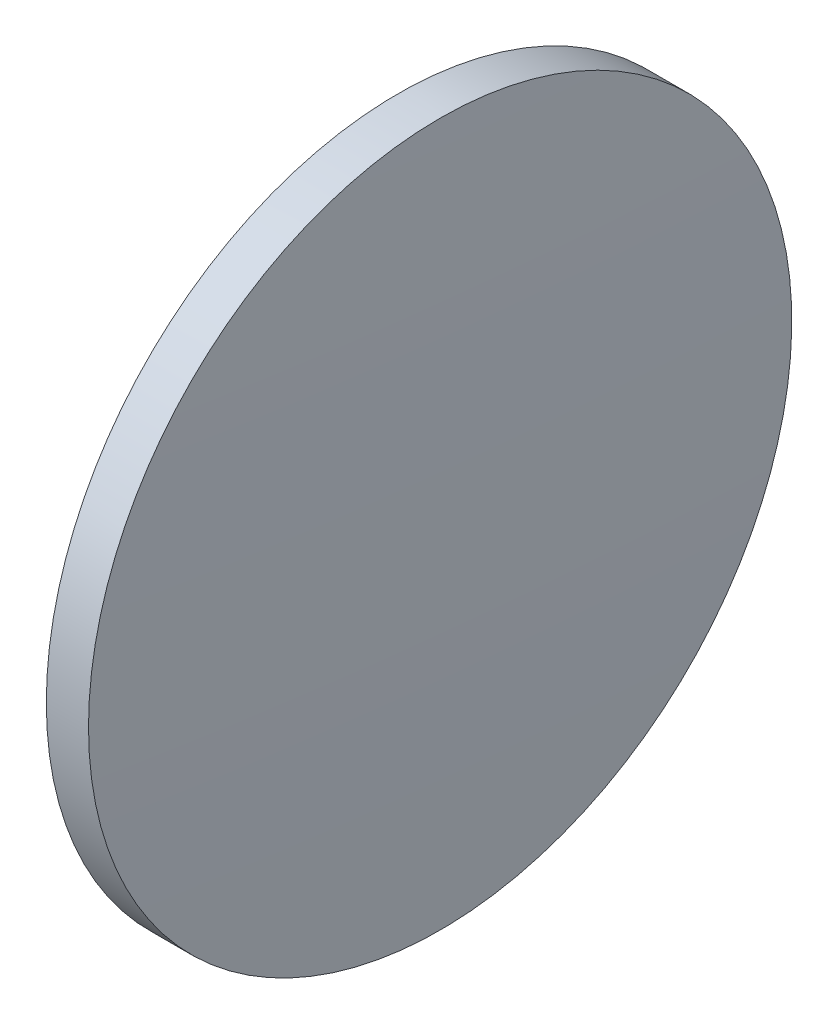
ISO-10303-21;
HEADER;
FILE_DESCRIPTION(('STEP AP214'),'2;1');
FILE_NAME('part.step','',(''),(''),'','','');
FILE_SCHEMA(('AUTOMOTIVE_DESIGN { 1 0 10303 214 1 1 1 1 }'));
ENDSEC;
DATA;
#1=APPLICATION_CONTEXT('core data for automotive mechanical design processes');
#2=APPLICATION_PROTOCOL_DEFINITION('international standard','automotive_design',2000,#1);
#3=PRODUCT_CONTEXT('',#1,'mechanical');
#4=PRODUCT('Part','Part','',(#3));
#5=PRODUCT_RELATED_PRODUCT_CATEGORY('part','',(#4));
#6=PRODUCT_DEFINITION_FORMATION('','',#4);
#7=PRODUCT_DEFINITION_CONTEXT('part definition',#1,'design');
#8=PRODUCT_DEFINITION('design','',#6,#7);
#9=PRODUCT_DEFINITION_SHAPE('','',#8);
#10=(LENGTH_UNIT() NAMED_UNIT(*) SI_UNIT(.MILLI.,.METRE.));
#11=(NAMED_UNIT(*) PLANE_ANGLE_UNIT() SI_UNIT($,.RADIAN.));
#12=(NAMED_UNIT(*) SI_UNIT($,.STERADIAN.) SOLID_ANGLE_UNIT());
#13=UNCERTAINTY_MEASURE_WITH_UNIT(LENGTH_MEASURE(1.E-05),#10,'distance_accuracy_value','');
#14=(GEOMETRIC_REPRESENTATION_CONTEXT(3) GLOBAL_UNCERTAINTY_ASSIGNED_CONTEXT((#13)) GLOBAL_UNIT_ASSIGNED_CONTEXT((#10,
#11,#12)) REPRESENTATION_CONTEXT('',''));
#15=CARTESIAN_POINT('',(0.,0.,0.));
#16=DIRECTION('',(0.,0.,1.));
#17=DIRECTION('',(1.,0.,0.));
#18=AXIS2_PLACEMENT_3D('',#15,#16,#17);
#19=CARTESIAN_POINT('',(-332.46497573729,32.629645364239,0.));
#20=DIRECTION('',(-1.,0.,0.));
#21=DIRECTION('',(0.,1.,0.));
#22=AXIS2_PLACEMENT_3D('',#19,#20,#21);
#23=SPHERICAL_SURFACE('',#22,390.725000000015);
#24=CARTESIAN_POINT('',(58.0600242627256,32.629645364239,0.));
#25=DIRECTION('',(-1.,0.,0.));
#26=DIRECTION('',(0.,0.,1.));
#27=AXIS2_PLACEMENT_3D('',#24,#25,#26);
#28=CIRCLE('',#27,12.5);
#29=CARTESIAN_POINT('',(58.0600242627256,32.629645364239,12.5));
#30=VERTEX_POINT('',#29);
#31=EDGE_CURVE('E10',#30,#30,#28,.T.);
#32=ORIENTED_EDGE('',*,*,#31,.F.);
#33=EDGE_LOOP('',(#32));
#34=FACE_BOUND('',#33,.T.);
#35=ADVANCED_FACE('F35',(#34),#23,.T.);
#36=CARTESIAN_POINT('',(54.5309166842886,32.629645364239,0.));
#37=DIRECTION('',(-1.,0.,0.));
#38=DIRECTION('',(0.,0.,1.));
#39=AXIS2_PLACEMENT_3D('',#36,#37,#38);
#40=CYLINDRICAL_SURFACE('',#39,12.5);
#41=CARTESIAN_POINT('',(56.5600242627256,32.629645364239,0.));
#42=DIRECTION('',(-1.,0.,0.));
#43=DIRECTION('',(0.,0.,1.));
#44=AXIS2_PLACEMENT_3D('',#41,#42,#43);
#45=CIRCLE('',#44,12.5);
#46=CARTESIAN_POINT('',(56.5600242627256,32.629645364239,12.5));
#47=VERTEX_POINT('',#46);
#48=EDGE_CURVE('E41',#47,#47,#45,.T.);
#49=ORIENTED_EDGE('',*,*,#48,.F.);
#50=EDGE_LOOP('',(#49));
#51=FACE_BOUND('',#50,.T.);
#52=ORIENTED_EDGE('',*,*,#31,.T.);
#53=EDGE_LOOP('',(#52));
#54=FACE_BOUND('',#53,.T.);
#55=ADVANCED_FACE('F49',(#51,#54),#40,.T.);
#56=CARTESIAN_POINT('',(56.5600242627256,32.629645364239,0.));
#57=DIRECTION('',(1.,0.,0.));
#58=DIRECTION('',(0.,0.,-1.));
#59=AXIS2_PLACEMENT_3D('',#56,#57,#58);
#60=PLANE('',#59);
#61=ORIENTED_EDGE('',*,*,#48,.T.);
#62=EDGE_LOOP('',(#61));
#63=FACE_BOUND('',#62,.T.);
#64=ADVANCED_FACE('F47',(#63),#60,.F.);
#65=CLOSED_SHELL('',(#35,#55,#64));
#66=MANIFOLD_SOLID_BREP('B2',#65);
#67=ADVANCED_BREP_SHAPE_REPRESENTATION('',(#18,#66),#14);
#68=SHAPE_DEFINITION_REPRESENTATION(#9,#67);
ENDSEC;
END-ISO-10303-21;
